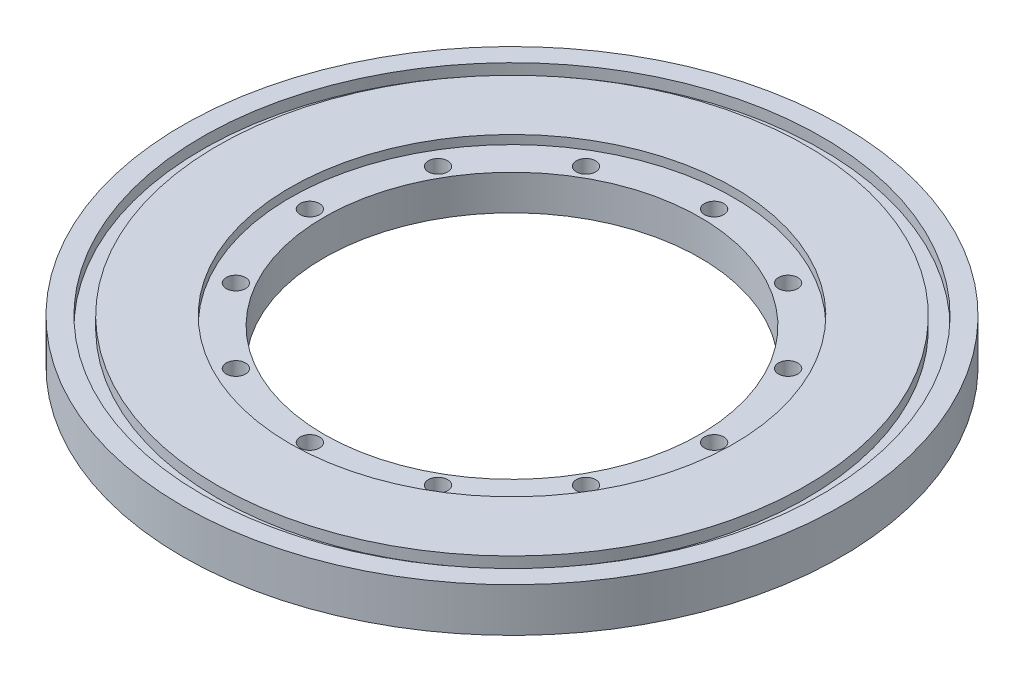
ISO-10303-21;
HEADER;
FILE_DESCRIPTION(('STEP AP214'),'2;1');
FILE_NAME('part.step','',(''),(''),'','','');
FILE_SCHEMA(('AUTOMOTIVE_DESIGN { 1 0 10303 214 1 1 1 1 }'));
ENDSEC;
DATA;
#1=APPLICATION_CONTEXT('core data for automotive mechanical design processes');
#2=APPLICATION_PROTOCOL_DEFINITION('international standard','automotive_design',2000,#1);
#3=PRODUCT_CONTEXT('',#1,'mechanical');
#4=PRODUCT('Part','Part','',(#3));
#5=PRODUCT_RELATED_PRODUCT_CATEGORY('part','',(#4));
#6=PRODUCT_DEFINITION_FORMATION('','',#4);
#7=PRODUCT_DEFINITION_CONTEXT('part definition',#1,'design');
#8=PRODUCT_DEFINITION('design','',#6,#7);
#9=PRODUCT_DEFINITION_SHAPE('','',#8);
#10=(LENGTH_UNIT() NAMED_UNIT(*) SI_UNIT(.MILLI.,.METRE.));
#11=(NAMED_UNIT(*) PLANE_ANGLE_UNIT() SI_UNIT($,.RADIAN.));
#12=(NAMED_UNIT(*) SI_UNIT($,.STERADIAN.) SOLID_ANGLE_UNIT());
#13=UNCERTAINTY_MEASURE_WITH_UNIT(LENGTH_MEASURE(1.E-05),#10,'distance_accuracy_value','');
#14=(GEOMETRIC_REPRESENTATION_CONTEXT(3) GLOBAL_UNCERTAINTY_ASSIGNED_CONTEXT((#13)) GLOBAL_UNIT_ASSIGNED_CONTEXT((#10,
#11,#12)) REPRESENTATION_CONTEXT('',''));
#15=CARTESIAN_POINT('',(0.,0.,0.));
#16=DIRECTION('',(0.,0.,1.));
#17=DIRECTION('',(1.,0.,0.));
#18=AXIS2_PLACEMENT_3D('',#15,#16,#17);
#19=CARTESIAN_POINT('',(0.,12.7,0.));
#20=DIRECTION('',(0.,1.,0.));
#21=DIRECTION('',(0.,0.,1.));
#22=AXIS2_PLACEMENT_3D('',#19,#20,#21);
#23=PLANE('',#22);
#24=CARTESIAN_POINT('',(0.,12.7,0.));
#25=DIRECTION('',(0.,1.,0.));
#26=DIRECTION('',(0.,0.,1.));
#27=AXIS2_PLACEMENT_3D('',#24,#25,#26);
#28=CIRCLE('',#27,64.135);
#29=CARTESIAN_POINT('',(0.,12.7,64.135));
#30=VERTEX_POINT('',#29);
#31=EDGE_CURVE('E66',#30,#30,#28,.T.);
#32=ORIENTED_EDGE('',*,*,#31,.F.);
#33=EDGE_LOOP('',(#32));
#34=FACE_BOUND('',#33,.T.);
#35=CARTESIAN_POINT('',(0.,12.7,0.));
#36=DIRECTION('',(0.,1.,0.));
#37=DIRECTION('',(0.,0.,1.));
#38=AXIS2_PLACEMENT_3D('',#35,#36,#37);
#39=CIRCLE('',#38,85.09);
#40=CARTESIAN_POINT('',(0.,12.7,85.09));
#41=VERTEX_POINT('',#40);
#42=EDGE_CURVE('E136',#41,#41,#39,.T.);
#43=ORIENTED_EDGE('',*,*,#42,.T.);
#44=EDGE_LOOP('',(#43));
#45=FACE_BOUND('',#44,.T.);
#46=ADVANCED_FACE('F37',(#34,#45),#23,.T.);
#47=CARTESIAN_POINT('',(0.,0.,0.));
#48=DIRECTION('',(0.,1.,0.));
#49=DIRECTION('',(0.,0.,1.));
#50=AXIS2_PLACEMENT_3D('',#47,#48,#49);
#51=CYLINDRICAL_SURFACE('',#50,54.356);
#52=CARTESIAN_POINT('',(0.,0.,0.));
#53=DIRECTION('',(0.,1.,0.));
#54=DIRECTION('',(0.,0.,1.));
#55=AXIS2_PLACEMENT_3D('',#52,#53,#54);
#56=CIRCLE('',#55,54.356);
#57=CARTESIAN_POINT('',(0.,0.,54.356));
#58=VERTEX_POINT('',#57);
#59=EDGE_CURVE('E52',#58,#58,#56,.T.);
#60=ORIENTED_EDGE('',*,*,#59,.F.);
#61=EDGE_LOOP('',(#60));
#62=FACE_BOUND('',#61,.T.);
#63=CARTESIAN_POINT('',(0.,10.16,0.));
#64=DIRECTION('',(0.,1.,0.));
#65=DIRECTION('',(0.,0.,1.));
#66=AXIS2_PLACEMENT_3D('',#63,#64,#65);
#67=CIRCLE('',#66,54.356);
#68=CARTESIAN_POINT('',(0.,10.16,54.356));
#69=VERTEX_POINT('',#68);
#70=EDGE_CURVE('E57',#69,#69,#67,.F.);
#71=ORIENTED_EDGE('',*,*,#70,.F.);
#72=EDGE_LOOP('',(#71));
#73=FACE_BOUND('',#72,.T.);
#74=ADVANCED_FACE('F131',(#62,#73),#51,.F.);
#75=CARTESIAN_POINT('',(0.,12.7,0.));
#76=DIRECTION('',(0.,-1.,0.));
#77=DIRECTION('',(0.,0.,-1.));
#78=AXIS2_PLACEMENT_3D('',#75,#76,#77);
#79=CYLINDRICAL_SURFACE('',#78,95.25);
#80=CARTESIAN_POINT('',(0.,12.7,0.));
#81=DIRECTION('',(0.,1.,0.));
#82=DIRECTION('',(0.,0.,1.));
#83=AXIS2_PLACEMENT_3D('',#80,#81,#82);
#84=CIRCLE('',#83,95.25);
#85=CARTESIAN_POINT('',(0.,12.7,95.25));
#86=VERTEX_POINT('',#85);
#87=EDGE_CURVE('E10',#86,#86,#84,.T.);
#88=ORIENTED_EDGE('',*,*,#87,.F.);
#89=EDGE_LOOP('',(#88));
#90=FACE_BOUND('',#89,.T.);
#91=CARTESIAN_POINT('',(0.,0.,0.));
#92=DIRECTION('',(0.,1.,0.));
#93=DIRECTION('',(0.,0.,1.));
#94=AXIS2_PLACEMENT_3D('',#91,#92,#93);
#95=CIRCLE('',#94,95.25);
#96=CARTESIAN_POINT('',(0.,0.,95.25));
#97=VERTEX_POINT('',#96);
#98=EDGE_CURVE('E46',#97,#97,#95,.T.);
#99=ORIENTED_EDGE('',*,*,#98,.T.);
#100=EDGE_LOOP('',(#99));
#101=FACE_BOUND('',#100,.T.);
#102=ADVANCED_FACE('F39',(#90,#101),#79,.T.);
#103=CARTESIAN_POINT('',(0.,12.7,0.));
#104=DIRECTION('',(0.,1.,0.));
#105=DIRECTION('',(0.,0.,1.));
#106=AXIS2_PLACEMENT_3D('',#103,#104,#105);
#107=CIRCLE('',#106,89.535);
#108=CARTESIAN_POINT('',(0.,12.7,89.535));
#109=VERTEX_POINT('',#108);
#110=EDGE_CURVE('E143',#109,#109,#107,.T.);
#111=ORIENTED_EDGE('',*,*,#110,.F.);
#112=EDGE_LOOP('',(#111));
#113=FACE_BOUND('',#112,.T.);
#114=ORIENTED_EDGE('',*,*,#87,.T.);
#115=EDGE_LOOP('',(#114));
#116=FACE_BOUND('',#115,.T.);
#117=ADVANCED_FACE('F133',(#113,#116),#23,.T.);
#118=CARTESIAN_POINT('',(0.,0.,0.));
#119=DIRECTION('',(0.,1.,0.));
#120=DIRECTION('',(0.,0.,1.));
#121=AXIS2_PLACEMENT_3D('',#118,#119,#120);
#122=PLANE('',#121);
#123=CARTESIAN_POINT('',(-50.593204089087,0.,-29.2099999999999));
#124=DIRECTION('',(0.,1.,0.));
#125=DIRECTION('',(0.86602540378444,0.,0.499999999999998));
#126=AXIS2_PLACEMENT_3D('',#123,#124,#125);
#127=CIRCLE('',#126,2.794);
#128=CARTESIAN_POINT('',(-48.1735291109132,0.,-27.8129999999999));
#129=VERTEX_POINT('',#128);
#130=EDGE_CURVE('E162',#129,#129,#127,.T.);
#131=ORIENTED_EDGE('',*,*,#130,.T.);
#132=EDGE_LOOP('',(#131));
#133=FACE_BOUND('',#132,.T.);
#134=CARTESIAN_POINT('',(-58.42,0.,2.03972339815216E-13));
#135=DIRECTION('',(0.,1.,0.));
#136=DIRECTION('',(1.,0.,0.));
#137=AXIS2_PLACEMENT_3D('',#134,#135,#136);
#138=CIRCLE('',#137,2.794);
#139=CARTESIAN_POINT('',(-55.626,0.,1.94217140954488E-13));
#140=VERTEX_POINT('',#139);
#141=EDGE_CURVE('E166',#140,#140,#138,.T.);
#142=ORIENTED_EDGE('',*,*,#141,.T.);
#143=EDGE_LOOP('',(#142));
#144=FACE_BOUND('',#143,.T.);
#145=CARTESIAN_POINT('',(-50.5932040890868,0.,29.2100000000002));
#146=DIRECTION('',(0.,1.,0.));
#147=DIRECTION('',(0.866025403784436,0.,-0.500000000000004));
#148=AXIS2_PLACEMENT_3D('',#145,#146,#147);
#149=CIRCLE('',#148,2.794);
#150=CARTESIAN_POINT('',(-48.1735291109131,0.,27.8130000000002));
#151=VERTEX_POINT('',#150);
#152=EDGE_CURVE('E170',#151,#151,#149,.T.);
#153=ORIENTED_EDGE('',*,*,#152,.T.);
#154=EDGE_LOOP('',(#153));
#155=FACE_BOUND('',#154,.T.);
#156=CARTESIAN_POINT('',(-29.2099999999997,0.,50.5932040890871));
#157=DIRECTION('',(0.,1.,0.));
#158=DIRECTION('',(0.499999999999995,0.,-0.866025403784442));
#159=AXIS2_PLACEMENT_3D('',#156,#157,#158);
#160=CIRCLE('',#159,2.794);
#161=CARTESIAN_POINT('',(-27.8129999999997,0.,48.1735291109133));
#162=VERTEX_POINT('',#161);
#163=EDGE_CURVE('E174',#162,#162,#160,.T.);
#164=ORIENTED_EDGE('',*,*,#163,.T.);
#165=EDGE_LOOP('',(#164));
#166=FACE_BOUND('',#165,.T.);
#167=CARTESIAN_POINT('',(0.,0.,58.42));
#168=DIRECTION('',(0.,1.,0.));
#169=DIRECTION('',(0.,0.,-1.));
#170=AXIS2_PLACEMENT_3D('',#167,#168,#169);
#171=CIRCLE('',#170,2.794);
#172=CARTESIAN_POINT('',(0.,0.,55.626));
#173=VERTEX_POINT('',#172);
#174=EDGE_CURVE('E178',#173,#173,#171,.T.);
#175=ORIENTED_EDGE('',*,*,#174,.T.);
#176=EDGE_LOOP('',(#175));
#177=FACE_BOUND('',#176,.T.);
#178=CARTESIAN_POINT('',(29.2100000000004,0.,50.5932040890867));
#179=DIRECTION('',(0.,1.,0.));
#180=DIRECTION('',(-0.500000000000007,0.,-0.866025403784435));
#181=AXIS2_PLACEMENT_3D('',#178,#179,#180);
#182=CIRCLE('',#181,2.794);
#183=CARTESIAN_POINT('',(27.8130000000004,0.,48.173529110913));
#184=VERTEX_POINT('',#183);
#185=EDGE_CURVE('E182',#184,#184,#182,.T.);
#186=ORIENTED_EDGE('',*,*,#185,.T.);
#187=EDGE_LOOP('',(#186));
#188=FACE_BOUND('',#187,.T.);
#189=CARTESIAN_POINT('',(50.5932040890872,0.,29.2099999999995));
#190=DIRECTION('',(0.,1.,0.));
#191=DIRECTION('',(-0.866025403784443,0.,-0.499999999999992));
#192=AXIS2_PLACEMENT_3D('',#189,#190,#191);
#193=CIRCLE('',#192,2.794);
#194=CARTESIAN_POINT('',(48.1735291109134,0.,27.8129999999995));
#195=VERTEX_POINT('',#194);
#196=EDGE_CURVE('E186',#195,#195,#193,.T.);
#197=ORIENTED_EDGE('',*,*,#196,.T.);
#198=EDGE_LOOP('',(#197));
#199=FACE_BOUND('',#198,.T.);
#200=CARTESIAN_POINT('',(58.42,0.,-6.11917019445647E-13));
#201=DIRECTION('',(0.,1.,0.));
#202=DIRECTION('',(-1.,0.,0.));
#203=AXIS2_PLACEMENT_3D('',#200,#201,#202);
#204=CIRCLE('',#203,2.794);
#205=CARTESIAN_POINT('',(55.626,0.,-5.82651422863464E-13));
#206=VERTEX_POINT('',#205);
#207=EDGE_CURVE('E158',#206,#206,#204,.T.);
#208=ORIENTED_EDGE('',*,*,#207,.T.);
#209=EDGE_LOOP('',(#208));
#210=FACE_BOUND('',#209,.T.);
#211=CARTESIAN_POINT('',(50.5932040890866,0.,-29.2100000000006));
#212=DIRECTION('',(0.,1.,0.));
#213=DIRECTION('',(-0.866025403784433,0.,0.50000000000001));
#214=AXIS2_PLACEMENT_3D('',#211,#212,#213);
#215=CIRCLE('',#214,2.794);
#216=CARTESIAN_POINT('',(48.1735291109129,0.,-27.8130000000006));
#217=VERTEX_POINT('',#216);
#218=EDGE_CURVE('E154',#217,#217,#215,.T.);
#219=ORIENTED_EDGE('',*,*,#218,.T.);
#220=EDGE_LOOP('',(#219));
#221=FACE_BOUND('',#220,.T.);
#222=CARTESIAN_POINT('',(29.2099999999993,0.,-50.5932040890873));
#223=DIRECTION('',(0.,1.,0.));
#224=DIRECTION('',(-0.499999999999989,0.,0.866025403784445));
#225=AXIS2_PLACEMENT_3D('',#222,#223,#224);
#226=CIRCLE('',#225,2.794);
#227=CARTESIAN_POINT('',(27.8129999999994,0.,-48.1735291109135));
#228=VERTEX_POINT('',#227);
#229=EDGE_CURVE('E150',#228,#228,#226,.T.);
#230=ORIENTED_EDGE('',*,*,#229,.T.);
#231=EDGE_LOOP('',(#230));
#232=FACE_BOUND('',#231,.T.);
#233=CARTESIAN_POINT('',(-29.2100000000001,0.,-50.5932040890869));
#234=DIRECTION('',(0.,1.,0.));
#235=DIRECTION('',(0.500000000000001,0.,0.866025403784438));
#236=AXIS2_PLACEMENT_3D('',#233,#234,#235);
#237=CIRCLE('',#236,2.794);
#238=CARTESIAN_POINT('',(-27.8130000000001,0.,-48.1735291109131));
#239=VERTEX_POINT('',#238);
#240=EDGE_CURVE('E73',#239,#239,#237,.T.);
#241=ORIENTED_EDGE('',*,*,#240,.T.);
#242=EDGE_LOOP('',(#241));
#243=FACE_BOUND('',#242,.T.);
#244=CARTESIAN_POINT('',(0.,0.,-58.42));
#245=DIRECTION('',(0.,1.,0.));
#246=DIRECTION('',(0.,0.,1.));
#247=AXIS2_PLACEMENT_3D('',#244,#245,#246);
#248=CIRCLE('',#247,2.794);
#249=CARTESIAN_POINT('',(0.,0.,-55.626));
#250=VERTEX_POINT('',#249);
#251=EDGE_CURVE('E67',#250,#250,#248,.T.);
#252=ORIENTED_EDGE('',*,*,#251,.T.);
#253=EDGE_LOOP('',(#252));
#254=FACE_BOUND('',#253,.T.);
#255=ORIENTED_EDGE('',*,*,#59,.T.);
#256=EDGE_LOOP('',(#255));
#257=FACE_BOUND('',#256,.T.);
#258=ORIENTED_EDGE('',*,*,#98,.F.);
#259=EDGE_LOOP('',(#258));
#260=FACE_BOUND('',#259,.T.);
#261=ADVANCED_FACE('F193',(#133,#144,#155,#166,#177,#188,#199,#210,#221,#232,#243,#254,#257,
#260),#122,.F.);
#262=CARTESIAN_POINT('',(0.,10.16,0.));
#263=DIRECTION('',(0.,1.,0.));
#264=DIRECTION('',(0.,0.,1.));
#265=AXIS2_PLACEMENT_3D('',#262,#263,#264);
#266=PLANE('',#265);
#267=CARTESIAN_POINT('',(-50.593204089087,10.16,-29.2099999999999));
#268=DIRECTION('',(0.,1.,0.));
#269=DIRECTION('',(0.,0.,1.));
#270=AXIS2_PLACEMENT_3D('',#267,#268,#269);
#271=CIRCLE('',#270,2.794);
#272=CARTESIAN_POINT('',(-50.593204089087,10.16,-26.4159999999999));
#273=VERTEX_POINT('',#272);
#274=EDGE_CURVE('E41',#273,#273,#271,.T.);
#275=ORIENTED_EDGE('',*,*,#274,.F.);
#276=EDGE_LOOP('',(#275));
#277=FACE_BOUND('',#276,.T.);
#278=CARTESIAN_POINT('',(-58.42,10.16,2.03972339815216E-13));
#279=DIRECTION('',(0.,1.,0.));
#280=DIRECTION('',(0.,0.,1.));
#281=AXIS2_PLACEMENT_3D('',#278,#279,#280);
#282=CIRCLE('',#281,2.794);
#283=CARTESIAN_POINT('',(-58.42,10.16,2.7940000000002));
#284=VERTEX_POINT('',#283);
#285=EDGE_CURVE('E104',#284,#284,#282,.T.);
#286=ORIENTED_EDGE('',*,*,#285,.F.);
#287=EDGE_LOOP('',(#286));
#288=FACE_BOUND('',#287,.T.);
#289=CARTESIAN_POINT('',(-50.5932040890868,10.16,29.2100000000002));
#290=DIRECTION('',(0.,1.,0.));
#291=DIRECTION('',(0.,0.,1.));
#292=AXIS2_PLACEMENT_3D('',#289,#290,#291);
#293=CIRCLE('',#292,2.794);
#294=CARTESIAN_POINT('',(-50.5932040890868,10.16,32.0040000000002));
#295=VERTEX_POINT('',#294);
#296=EDGE_CURVE('E101',#295,#295,#293,.T.);
#297=ORIENTED_EDGE('',*,*,#296,.F.);
#298=EDGE_LOOP('',(#297));
#299=FACE_BOUND('',#298,.T.);
#300=CARTESIAN_POINT('',(-29.2099999999997,10.16,50.5932040890871));
#301=DIRECTION('',(0.,1.,0.));
#302=DIRECTION('',(0.,0.,1.));
#303=AXIS2_PLACEMENT_3D('',#300,#301,#302);
#304=CIRCLE('',#303,2.794);
#305=CARTESIAN_POINT('',(-29.2099999999997,10.16,53.3872040890871));
#306=VERTEX_POINT('',#305);
#307=EDGE_CURVE('E97',#306,#306,#304,.T.);
#308=ORIENTED_EDGE('',*,*,#307,.F.);
#309=EDGE_LOOP('',(#308));
#310=FACE_BOUND('',#309,.T.);
#311=CARTESIAN_POINT('',(0.,10.16,58.42));
#312=DIRECTION('',(0.,1.,0.));
#313=DIRECTION('',(0.,0.,1.));
#314=AXIS2_PLACEMENT_3D('',#311,#312,#313);
#315=CIRCLE('',#314,2.794);
#316=CARTESIAN_POINT('',(0.,10.16,61.214));
#317=VERTEX_POINT('',#316);
#318=EDGE_CURVE('E93',#317,#317,#315,.T.);
#319=ORIENTED_EDGE('',*,*,#318,.F.);
#320=EDGE_LOOP('',(#319));
#321=FACE_BOUND('',#320,.T.);
#322=CARTESIAN_POINT('',(29.2100000000004,10.16,50.5932040890867));
#323=DIRECTION('',(0.,1.,0.));
#324=DIRECTION('',(0.,0.,1.));
#325=AXIS2_PLACEMENT_3D('',#322,#323,#324);
#326=CIRCLE('',#325,2.794);
#327=CARTESIAN_POINT('',(29.2100000000004,10.16,53.3872040890867));
#328=VERTEX_POINT('',#327);
#329=EDGE_CURVE('E89',#328,#328,#326,.T.);
#330=ORIENTED_EDGE('',*,*,#329,.F.);
#331=EDGE_LOOP('',(#330));
#332=FACE_BOUND('',#331,.T.);
#333=CARTESIAN_POINT('',(50.5932040890872,10.16,29.2099999999995));
#334=DIRECTION('',(0.,1.,0.));
#335=DIRECTION('',(0.,0.,1.));
#336=AXIS2_PLACEMENT_3D('',#333,#334,#335);
#337=CIRCLE('',#336,2.794);
#338=CARTESIAN_POINT('',(50.5932040890872,10.16,32.0039999999995));
#339=VERTEX_POINT('',#338);
#340=EDGE_CURVE('E85',#339,#339,#337,.T.);
#341=ORIENTED_EDGE('',*,*,#340,.F.);
#342=EDGE_LOOP('',(#341));
#343=FACE_BOUND('',#342,.T.);
#344=CARTESIAN_POINT('',(58.42,10.16,-6.11917019445647E-13));
#345=DIRECTION('',(0.,1.,0.));
#346=DIRECTION('',(0.,0.,1.));
#347=AXIS2_PLACEMENT_3D('',#344,#345,#346);
#348=CIRCLE('',#347,2.794);
#349=CARTESIAN_POINT('',(58.42,10.16,2.79399999999939));
#350=VERTEX_POINT('',#349);
#351=EDGE_CURVE('E81',#350,#350,#348,.T.);
#352=ORIENTED_EDGE('',*,*,#351,.F.);
#353=EDGE_LOOP('',(#352));
#354=FACE_BOUND('',#353,.T.);
#355=CARTESIAN_POINT('',(50.5932040890866,10.16,-29.2100000000006));
#356=DIRECTION('',(0.,1.,0.));
#357=DIRECTION('',(0.,0.,1.));
#358=AXIS2_PLACEMENT_3D('',#355,#356,#357);
#359=CIRCLE('',#358,2.794);
#360=CARTESIAN_POINT('',(50.5932040890866,10.16,-26.4160000000006));
#361=VERTEX_POINT('',#360);
#362=EDGE_CURVE('E77',#361,#361,#359,.T.);
#363=ORIENTED_EDGE('',*,*,#362,.F.);
#364=EDGE_LOOP('',(#363));
#365=FACE_BOUND('',#364,.T.);
#366=CARTESIAN_POINT('',(29.2099999999993,10.16,-50.5932040890873));
#367=DIRECTION('',(0.,1.,0.));
#368=DIRECTION('',(0.,0.,1.));
#369=AXIS2_PLACEMENT_3D('',#366,#367,#368);
#370=CIRCLE('',#369,2.794);
#371=CARTESIAN_POINT('',(29.2099999999993,10.16,-47.7992040890873));
#372=VERTEX_POINT('',#371);
#373=EDGE_CURVE('E72',#372,#372,#370,.T.);
#374=ORIENTED_EDGE('',*,*,#373,.F.);
#375=EDGE_LOOP('',(#374));
#376=FACE_BOUND('',#375,.T.);
#377=CARTESIAN_POINT('',(-29.2100000000001,10.16,-50.5932040890869));
#378=DIRECTION('',(0.,1.,0.));
#379=DIRECTION('',(0.,0.,1.));
#380=AXIS2_PLACEMENT_3D('',#377,#378,#379);
#381=CIRCLE('',#380,2.794);
#382=CARTESIAN_POINT('',(-29.2100000000001,10.16,-47.7992040890869));
#383=VERTEX_POINT('',#382);
#384=EDGE_CURVE('E68',#383,#383,#381,.T.);
#385=ORIENTED_EDGE('',*,*,#384,.F.);
#386=EDGE_LOOP('',(#385));
#387=FACE_BOUND('',#386,.T.);
#388=CARTESIAN_POINT('',(0.,10.16,-58.42));
#389=DIRECTION('',(0.,1.,0.));
#390=DIRECTION('',(0.,0.,1.));
#391=AXIS2_PLACEMENT_3D('',#388,#389,#390);
#392=CIRCLE('',#391,2.794);
#393=CARTESIAN_POINT('',(0.,10.16,-55.626));
#394=VERTEX_POINT('',#393);
#395=EDGE_CURVE('E62',#394,#394,#392,.T.);
#396=ORIENTED_EDGE('',*,*,#395,.F.);
#397=EDGE_LOOP('',(#396));
#398=FACE_BOUND('',#397,.T.);
#399=CARTESIAN_POINT('',(0.,10.16,0.));
#400=DIRECTION('',(0.,1.,0.));
#401=DIRECTION('',(0.,0.,1.));
#402=AXIS2_PLACEMENT_3D('',#399,#400,#401);
#403=CIRCLE('',#402,64.135);
#404=CARTESIAN_POINT('',(0.,10.16,64.135));
#405=VERTEX_POINT('',#404);
#406=EDGE_CURVE('E61',#405,#405,#403,.T.);
#407=ORIENTED_EDGE('',*,*,#406,.T.);
#408=EDGE_LOOP('',(#407));
#409=FACE_BOUND('',#408,.T.);
#410=ORIENTED_EDGE('',*,*,#70,.T.);
#411=EDGE_LOOP('',(#410));
#412=FACE_BOUND('',#411,.T.);
#413=ADVANCED_FACE('F222',(#277,#288,#299,#310,#321,#332,#343,#354,#365,#376,#387,#398,#409,
#412),#266,.T.);
#414=CARTESIAN_POINT('',(0.,10.16,0.));
#415=DIRECTION('',(0.,1.,0.));
#416=DIRECTION('',(0.,0.,1.));
#417=AXIS2_PLACEMENT_3D('',#414,#415,#416);
#418=CYLINDRICAL_SURFACE('',#417,64.135);
#419=ORIENTED_EDGE('',*,*,#406,.F.);
#420=EDGE_LOOP('',(#419));
#421=FACE_BOUND('',#420,.T.);
#422=ORIENTED_EDGE('',*,*,#31,.T.);
#423=EDGE_LOOP('',(#422));
#424=FACE_BOUND('',#423,.T.);
#425=ADVANCED_FACE('F127',(#421,#424),#418,.F.);
#426=CARTESIAN_POINT('',(0.,0.,-58.42));
#427=DIRECTION('',(0.,1.,0.));
#428=DIRECTION('',(0.,0.,1.));
#429=AXIS2_PLACEMENT_3D('',#426,#427,#428);
#430=CYLINDRICAL_SURFACE('',#429,2.794);
#431=ORIENTED_EDGE('',*,*,#395,.T.);
#432=EDGE_LOOP('',(#431));
#433=FACE_BOUND('',#432,.T.);
#434=ORIENTED_EDGE('',*,*,#251,.F.);
#435=EDGE_LOOP('',(#434));
#436=FACE_BOUND('',#435,.T.);
#437=ADVANCED_FACE('F217',(#433,#436),#430,.F.);
#438=CARTESIAN_POINT('',(-29.2100000000001,0.,-50.5932040890869));
#439=DIRECTION('',(0.,1.,0.));
#440=DIRECTION('',(0.,0.,1.));
#441=AXIS2_PLACEMENT_3D('',#438,#439,#440);
#442=CYLINDRICAL_SURFACE('',#441,2.794);
#443=ORIENTED_EDGE('',*,*,#384,.T.);
#444=EDGE_LOOP('',(#443));
#445=FACE_BOUND('',#444,.T.);
#446=ORIENTED_EDGE('',*,*,#240,.F.);
#447=EDGE_LOOP('',(#446));
#448=FACE_BOUND('',#447,.T.);
#449=ADVANCED_FACE('F214',(#445,#448),#442,.F.);
#450=CARTESIAN_POINT('',(29.2099999999993,0.,-50.5932040890873));
#451=DIRECTION('',(0.,1.,0.));
#452=DIRECTION('',(0.,0.,1.));
#453=AXIS2_PLACEMENT_3D('',#450,#451,#452);
#454=CYLINDRICAL_SURFACE('',#453,2.794);
#455=ORIENTED_EDGE('',*,*,#373,.T.);
#456=EDGE_LOOP('',(#455));
#457=FACE_BOUND('',#456,.T.);
#458=ORIENTED_EDGE('',*,*,#229,.F.);
#459=EDGE_LOOP('',(#458));
#460=FACE_BOUND('',#459,.T.);
#461=ADVANCED_FACE('F209',(#457,#460),#454,.F.);
#462=CARTESIAN_POINT('',(50.5932040890866,0.,-29.2100000000006));
#463=DIRECTION('',(0.,1.,0.));
#464=DIRECTION('',(0.,0.,1.));
#465=AXIS2_PLACEMENT_3D('',#462,#463,#464);
#466=CYLINDRICAL_SURFACE('',#465,2.794);
#467=ORIENTED_EDGE('',*,*,#362,.T.);
#468=EDGE_LOOP('',(#467));
#469=FACE_BOUND('',#468,.T.);
#470=ORIENTED_EDGE('',*,*,#218,.F.);
#471=EDGE_LOOP('',(#470));
#472=FACE_BOUND('',#471,.T.);
#473=ADVANCED_FACE('F199',(#469,#472),#466,.F.);
#474=CARTESIAN_POINT('',(58.42,0.,-6.11917019445647E-13));
#475=DIRECTION('',(0.,1.,0.));
#476=DIRECTION('',(0.,0.,1.));
#477=AXIS2_PLACEMENT_3D('',#474,#475,#476);
#478=CYLINDRICAL_SURFACE('',#477,2.794);
#479=ORIENTED_EDGE('',*,*,#351,.T.);
#480=EDGE_LOOP('',(#479));
#481=FACE_BOUND('',#480,.T.);
#482=ORIENTED_EDGE('',*,*,#207,.F.);
#483=EDGE_LOOP('',(#482));
#484=FACE_BOUND('',#483,.T.);
#485=ADVANCED_FACE('F196',(#481,#484),#478,.F.);
#486=CARTESIAN_POINT('',(50.5932040890872,0.,29.2099999999995));
#487=DIRECTION('',(0.,1.,0.));
#488=DIRECTION('',(0.,0.,1.));
#489=AXIS2_PLACEMENT_3D('',#486,#487,#488);
#490=CYLINDRICAL_SURFACE('',#489,2.794);
#491=ORIENTED_EDGE('',*,*,#340,.T.);
#492=EDGE_LOOP('',(#491));
#493=FACE_BOUND('',#492,.T.);
#494=ORIENTED_EDGE('',*,*,#196,.F.);
#495=EDGE_LOOP('',(#494));
#496=FACE_BOUND('',#495,.T.);
#497=ADVANCED_FACE('F198',(#493,#496),#490,.F.);
#498=CARTESIAN_POINT('',(29.2100000000004,0.,50.5932040890867));
#499=DIRECTION('',(0.,1.,0.));
#500=DIRECTION('',(0.,0.,1.));
#501=AXIS2_PLACEMENT_3D('',#498,#499,#500);
#502=CYLINDRICAL_SURFACE('',#501,2.794);
#503=ORIENTED_EDGE('',*,*,#329,.T.);
#504=EDGE_LOOP('',(#503));
#505=FACE_BOUND('',#504,.T.);
#506=ORIENTED_EDGE('',*,*,#185,.F.);
#507=EDGE_LOOP('',(#506));
#508=FACE_BOUND('',#507,.T.);
#509=ADVANCED_FACE('F206',(#505,#508),#502,.F.);
#510=CARTESIAN_POINT('',(0.,0.,58.42));
#511=DIRECTION('',(0.,1.,0.));
#512=DIRECTION('',(0.,0.,1.));
#513=AXIS2_PLACEMENT_3D('',#510,#511,#512);
#514=CYLINDRICAL_SURFACE('',#513,2.794);
#515=ORIENTED_EDGE('',*,*,#318,.T.);
#516=EDGE_LOOP('',(#515));
#517=FACE_BOUND('',#516,.T.);
#518=ORIENTED_EDGE('',*,*,#174,.F.);
#519=EDGE_LOOP('',(#518));
#520=FACE_BOUND('',#519,.T.);
#521=ADVANCED_FACE('F253',(#517,#520),#514,.F.);
#522=CARTESIAN_POINT('',(-29.2099999999997,0.,50.5932040890871));
#523=DIRECTION('',(0.,1.,0.));
#524=DIRECTION('',(0.,0.,1.));
#525=AXIS2_PLACEMENT_3D('',#522,#523,#524);
#526=CYLINDRICAL_SURFACE('',#525,2.794);
#527=ORIENTED_EDGE('',*,*,#307,.T.);
#528=EDGE_LOOP('',(#527));
#529=FACE_BOUND('',#528,.T.);
#530=ORIENTED_EDGE('',*,*,#163,.F.);
#531=EDGE_LOOP('',(#530));
#532=FACE_BOUND('',#531,.T.);
#533=ADVANCED_FACE('F258',(#529,#532),#526,.F.);
#534=CARTESIAN_POINT('',(-50.5932040890868,0.,29.2100000000002));
#535=DIRECTION('',(0.,1.,0.));
#536=DIRECTION('',(0.,0.,1.));
#537=AXIS2_PLACEMENT_3D('',#534,#535,#536);
#538=CYLINDRICAL_SURFACE('',#537,2.794);
#539=ORIENTED_EDGE('',*,*,#296,.T.);
#540=EDGE_LOOP('',(#539));
#541=FACE_BOUND('',#540,.T.);
#542=ORIENTED_EDGE('',*,*,#152,.F.);
#543=EDGE_LOOP('',(#542));
#544=FACE_BOUND('',#543,.T.);
#545=ADVANCED_FACE('F264',(#541,#544),#538,.F.);
#546=CARTESIAN_POINT('',(-58.42,0.,2.03972339815216E-13));
#547=DIRECTION('',(0.,1.,0.));
#548=DIRECTION('',(0.,0.,1.));
#549=AXIS2_PLACEMENT_3D('',#546,#547,#548);
#550=CYLINDRICAL_SURFACE('',#549,2.794);
#551=ORIENTED_EDGE('',*,*,#285,.T.);
#552=EDGE_LOOP('',(#551));
#553=FACE_BOUND('',#552,.T.);
#554=ORIENTED_EDGE('',*,*,#141,.F.);
#555=EDGE_LOOP('',(#554));
#556=FACE_BOUND('',#555,.T.);
#557=ADVANCED_FACE('F268',(#553,#556),#550,.F.);
#558=CARTESIAN_POINT('',(-50.593204089087,0.,-29.2099999999999));
#559=DIRECTION('',(0.,1.,0.));
#560=DIRECTION('',(0.,0.,1.));
#561=AXIS2_PLACEMENT_3D('',#558,#559,#560);
#562=CYLINDRICAL_SURFACE('',#561,2.794);
#563=ORIENTED_EDGE('',*,*,#274,.T.);
#564=EDGE_LOOP('',(#563));
#565=FACE_BOUND('',#564,.T.);
#566=ORIENTED_EDGE('',*,*,#130,.F.);
#567=EDGE_LOOP('',(#566));
#568=FACE_BOUND('',#567,.T.);
#569=ADVANCED_FACE('F272',(#565,#568),#562,.F.);
#570=CARTESIAN_POINT('',(0.,9.525,0.));
#571=DIRECTION('',(0.,1.,0.));
#572=DIRECTION('',(0.,0.,1.));
#573=AXIS2_PLACEMENT_3D('',#570,#571,#572);
#574=CYLINDRICAL_SURFACE('',#573,89.535);
#575=CARTESIAN_POINT('',(0.,9.525,0.));
#576=DIRECTION('',(0.,1.,0.));
#577=DIRECTION('',(0.,0.,1.));
#578=AXIS2_PLACEMENT_3D('',#575,#576,#577);
#579=CIRCLE('',#578,89.535);
#580=CARTESIAN_POINT('',(0.,9.525,89.535));
#581=VERTEX_POINT('',#580);
#582=EDGE_CURVE('E146',#581,#581,#579,.T.);
#583=ORIENTED_EDGE('',*,*,#582,.F.);
#584=EDGE_LOOP('',(#583));
#585=FACE_BOUND('',#584,.T.);
#586=ORIENTED_EDGE('',*,*,#110,.T.);
#587=EDGE_LOOP('',(#586));
#588=FACE_BOUND('',#587,.T.);
#589=ADVANCED_FACE('F275',(#585,#588),#574,.F.);
#590=CARTESIAN_POINT('',(0.,9.525,0.));
#591=DIRECTION('',(0.,1.,0.));
#592=DIRECTION('',(0.,0.,1.));
#593=AXIS2_PLACEMENT_3D('',#590,#591,#592);
#594=PLANE('',#593);
#595=CARTESIAN_POINT('',(0.,9.525,0.));
#596=DIRECTION('',(0.,1.,0.));
#597=DIRECTION('',(0.,0.,1.));
#598=AXIS2_PLACEMENT_3D('',#595,#596,#597);
#599=CIRCLE('',#598,85.09);
#600=CARTESIAN_POINT('',(0.,9.525,85.09));
#601=VERTEX_POINT('',#600);
#602=EDGE_CURVE('E139',#601,#601,#599,.T.);
#603=ORIENTED_EDGE('',*,*,#602,.F.);
#604=EDGE_LOOP('',(#603));
#605=FACE_BOUND('',#604,.T.);
#606=ORIENTED_EDGE('',*,*,#582,.T.);
#607=EDGE_LOOP('',(#606));
#608=FACE_BOUND('',#607,.T.);
#609=ADVANCED_FACE('F281',(#605,#608),#594,.T.);
#610=CARTESIAN_POINT('',(0.,9.525,0.));
#611=DIRECTION('',(0.,1.,0.));
#612=DIRECTION('',(0.,0.,1.));
#613=AXIS2_PLACEMENT_3D('',#610,#611,#612);
#614=CYLINDRICAL_SURFACE('',#613,85.09);
#615=ORIENTED_EDGE('',*,*,#602,.T.);
#616=EDGE_LOOP('',(#615));
#617=FACE_BOUND('',#616,.T.);
#618=ORIENTED_EDGE('',*,*,#42,.F.);
#619=EDGE_LOOP('',(#618));
#620=FACE_BOUND('',#619,.T.);
#621=ADVANCED_FACE('F285',(#617,#620),#614,.T.);
#622=CLOSED_SHELL('',(#46,#74,#102,#117,#261,#413,#425,#437,#449,#461,#473,#485,#497,#509,#521,
#533,#545,#557,#569,#589,#609,#621));
#623=MANIFOLD_SOLID_BREP('B2',#622);
#624=ADVANCED_BREP_SHAPE_REPRESENTATION('',(#18,#623),#14);
#625=SHAPE_DEFINITION_REPRESENTATION(#9,#624);
ENDSEC;
END-ISO-10303-21;
